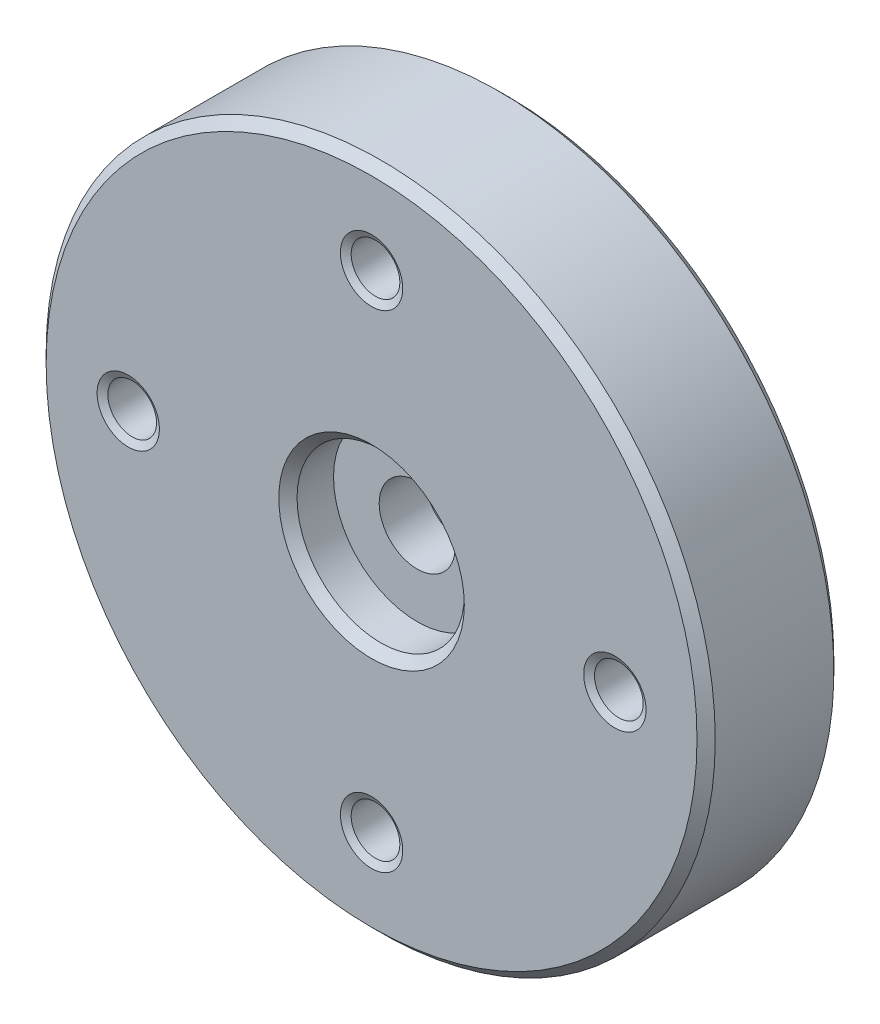
ISO-10303-21;
HEADER;
FILE_DESCRIPTION(('STEP AP214'),'2;1');
FILE_NAME('part.step','',(''),(''),'','','');
FILE_SCHEMA(('AUTOMOTIVE_DESIGN { 1 0 10303 214 1 1 1 1 }'));
ENDSEC;
DATA;
#1=APPLICATION_CONTEXT('core data for automotive mechanical design processes');
#2=APPLICATION_PROTOCOL_DEFINITION('international standard','automotive_design',2000,#1);
#3=PRODUCT_CONTEXT('',#1,'mechanical');
#4=PRODUCT('Part','Part','',(#3));
#5=PRODUCT_RELATED_PRODUCT_CATEGORY('part','',(#4));
#6=PRODUCT_DEFINITION_FORMATION('','',#4);
#7=PRODUCT_DEFINITION_CONTEXT('part definition',#1,'design');
#8=PRODUCT_DEFINITION('design','',#6,#7);
#9=PRODUCT_DEFINITION_SHAPE('','',#8);
#10=(LENGTH_UNIT() NAMED_UNIT(*) SI_UNIT(.MILLI.,.METRE.));
#11=(NAMED_UNIT(*) PLANE_ANGLE_UNIT() SI_UNIT($,.RADIAN.));
#12=(NAMED_UNIT(*) SI_UNIT($,.STERADIAN.) SOLID_ANGLE_UNIT());
#13=UNCERTAINTY_MEASURE_WITH_UNIT(LENGTH_MEASURE(1.E-05),#10,'distance_accuracy_value','');
#14=(GEOMETRIC_REPRESENTATION_CONTEXT(3) GLOBAL_UNCERTAINTY_ASSIGNED_CONTEXT((#13)) GLOBAL_UNIT_ASSIGNED_CONTEXT((#10,
#11,#12)) REPRESENTATION_CONTEXT('',''));
#15=CARTESIAN_POINT('',(0.,0.,0.));
#16=DIRECTION('',(0.,0.,1.));
#17=DIRECTION('',(1.,0.,0.));
#18=AXIS2_PLACEMENT_3D('',#15,#16,#17);
#19=CARTESIAN_POINT('',(0.,0.,0.));
#20=DIRECTION('',(0.,0.,-1.));
#21=DIRECTION('',(-1.,0.,0.));
#22=AXIS2_PLACEMENT_3D('',#19,#20,#21);
#23=CYLINDRICAL_SURFACE('',#22,2.75);
#24=CARTESIAN_POINT('',(0.,0.,-0.300000000000006));
#25=DIRECTION('',(0.,0.,1.));
#26=DIRECTION('',(1.,0.,0.));
#27=AXIS2_PLACEMENT_3D('',#24,#25,#26);
#28=CIRCLE('',#27,2.75);
#29=CARTESIAN_POINT('',(2.75,0.,-0.300000000000006));
#30=VERTEX_POINT('',#29);
#31=EDGE_CURVE('E59',#30,#30,#28,.T.);
#32=ORIENTED_EDGE('',*,*,#31,.T.);
#33=EDGE_LOOP('',(#32));
#34=FACE_BOUND('',#33,.T.);
#35=CARTESIAN_POINT('',(0.,0.,-1.5));
#36=DIRECTION('',(0.,0.,-1.));
#37=DIRECTION('',(-1.,0.,0.));
#38=AXIS2_PLACEMENT_3D('',#35,#36,#37);
#39=CIRCLE('',#38,2.75);
#40=CARTESIAN_POINT('',(-2.75,0.,-1.5));
#41=VERTEX_POINT('',#40);
#42=EDGE_CURVE('E83',#41,#41,#39,.T.);
#43=ORIENTED_EDGE('',*,*,#42,.T.);
#44=EDGE_LOOP('',(#43));
#45=FACE_BOUND('',#44,.T.);
#46=ADVANCED_FACE('F36',(#34,#45),#23,.F.);
#47=CARTESIAN_POINT('',(0.,2.75,0.));
#48=DIRECTION('',(0.,0.,1.));
#49=DIRECTION('',(1.,0.,0.));
#50=AXIS2_PLACEMENT_3D('',#47,#48,#49);
#51=PLANE('',#50);
#52=CARTESIAN_POINT('',(0.,0.,0.));
#53=DIRECTION('',(0.,0.,1.));
#54=DIRECTION('',(1.,0.,0.));
#55=AXIS2_PLACEMENT_3D('',#52,#53,#54);
#56=CIRCLE('',#55,3.05);
#57=CARTESIAN_POINT('',(3.05,0.,0.));
#58=VERTEX_POINT('',#57);
#59=EDGE_CURVE('E62',#58,#58,#56,.F.);
#60=ORIENTED_EDGE('',*,*,#59,.T.);
#61=EDGE_LOOP('',(#60));
#62=FACE_BOUND('',#61,.T.);
#63=CARTESIAN_POINT('',(0.,0.,0.));
#64=DIRECTION('',(0.,0.,1.));
#65=DIRECTION('',(1.,0.,0.));
#66=AXIS2_PLACEMENT_3D('',#63,#64,#65);
#67=CIRCLE('',#66,10.7);
#68=CARTESIAN_POINT('',(10.7,0.,0.));
#69=VERTEX_POINT('',#68);
#70=EDGE_CURVE('E65',#69,#69,#67,.T.);
#71=ORIENTED_EDGE('',*,*,#70,.T.);
#72=EDGE_LOOP('',(#71));
#73=FACE_BOUND('',#72,.T.);
#74=CARTESIAN_POINT('',(0.,8.,0.));
#75=DIRECTION('',(0.,0.,1.));
#76=DIRECTION('',(1.,0.,0.));
#77=AXIS2_PLACEMENT_3D('',#74,#75,#76);
#78=CIRCLE('',#77,1.025);
#79=CARTESIAN_POINT('',(1.025,8.,0.));
#80=VERTEX_POINT('',#79);
#81=EDGE_CURVE('E128',#80,#80,#78,.T.);
#82=ORIENTED_EDGE('',*,*,#81,.F.);
#83=EDGE_LOOP('',(#82));
#84=FACE_BOUND('',#83,.T.);
#85=CARTESIAN_POINT('',(8.,0.,0.));
#86=DIRECTION('',(0.,0.,1.));
#87=DIRECTION('',(1.,0.,0.));
#88=AXIS2_PLACEMENT_3D('',#85,#86,#87);
#89=CIRCLE('',#88,1.025);
#90=CARTESIAN_POINT('',(9.025,0.,0.));
#91=VERTEX_POINT('',#90);
#92=EDGE_CURVE('E116',#91,#91,#89,.T.);
#93=ORIENTED_EDGE('',*,*,#92,.F.);
#94=EDGE_LOOP('',(#93));
#95=FACE_BOUND('',#94,.T.);
#96=CARTESIAN_POINT('',(0.,-8.,0.));
#97=DIRECTION('',(0.,0.,1.));
#98=DIRECTION('',(1.,0.,0.));
#99=AXIS2_PLACEMENT_3D('',#96,#97,#98);
#100=CIRCLE('',#99,1.025);
#101=CARTESIAN_POINT('',(1.025,-8.,0.));
#102=VERTEX_POINT('',#101);
#103=EDGE_CURVE('E104',#102,#102,#100,.T.);
#104=ORIENTED_EDGE('',*,*,#103,.F.);
#105=EDGE_LOOP('',(#104));
#106=FACE_BOUND('',#105,.T.);
#107=CARTESIAN_POINT('',(-8.,0.,0.));
#108=DIRECTION('',(0.,0.,1.));
#109=DIRECTION('',(1.,0.,0.));
#110=AXIS2_PLACEMENT_3D('',#107,#108,#109);
#111=CIRCLE('',#110,1.025);
#112=CARTESIAN_POINT('',(-6.975,0.,0.));
#113=VERTEX_POINT('',#112);
#114=EDGE_CURVE('E92',#113,#113,#111,.T.);
#115=ORIENTED_EDGE('',*,*,#114,.F.);
#116=EDGE_LOOP('',(#115));
#117=FACE_BOUND('',#116,.T.);
#118=ADVANCED_FACE('F158',(#62,#73,#84,#95,#106,#117),#51,.T.);
#119=CARTESIAN_POINT('',(0.,0.,0.));
#120=DIRECTION('',(0.,0.,-1.));
#121=DIRECTION('',(-1.,0.,0.));
#122=AXIS2_PLACEMENT_3D('',#119,#120,#121);
#123=CYLINDRICAL_SURFACE('',#122,11.);
#124=CARTESIAN_POINT('',(0.,0.,-4.2));
#125=DIRECTION('',(0.,0.,-1.));
#126=DIRECTION('',(-1.,0.,0.));
#127=AXIS2_PLACEMENT_3D('',#124,#125,#126);
#128=CIRCLE('',#127,11.);
#129=CARTESIAN_POINT('',(-11.,0.,-4.2));
#130=VERTEX_POINT('',#129);
#131=EDGE_CURVE('E10',#130,#130,#128,.F.);
#132=ORIENTED_EDGE('',*,*,#131,.T.);
#133=EDGE_LOOP('',(#132));
#134=FACE_BOUND('',#133,.T.);
#135=CARTESIAN_POINT('',(0.,0.,-0.299999999999998));
#136=DIRECTION('',(0.,0.,1.));
#137=DIRECTION('',(1.,0.,0.));
#138=AXIS2_PLACEMENT_3D('',#135,#136,#137);
#139=CIRCLE('',#138,11.);
#140=CARTESIAN_POINT('',(11.,0.,-0.299999999999998));
#141=VERTEX_POINT('',#140);
#142=EDGE_CURVE('E43',#141,#141,#139,.F.);
#143=ORIENTED_EDGE('',*,*,#142,.T.);
#144=EDGE_LOOP('',(#143));
#145=FACE_BOUND('',#144,.T.);
#146=ADVANCED_FACE('F161',(#134,#145),#123,.T.);
#147=CARTESIAN_POINT('',(0.,11.,-4.5));
#148=DIRECTION('',(0.,0.,-1.));
#149=DIRECTION('',(-1.,0.,0.));
#150=AXIS2_PLACEMENT_3D('',#147,#148,#149);
#151=PLANE('',#150);
#152=CARTESIAN_POINT('',(0.,0.,-4.5));
#153=DIRECTION('',(0.,0.,-1.));
#154=DIRECTION('',(-1.,0.,0.));
#155=AXIS2_PLACEMENT_3D('',#152,#153,#154);
#156=CIRCLE('',#155,10.7);
#157=CARTESIAN_POINT('',(-10.7,0.,-4.5));
#158=VERTEX_POINT('',#157);
#159=EDGE_CURVE('E47',#158,#158,#156,.T.);
#160=ORIENTED_EDGE('',*,*,#159,.T.);
#161=EDGE_LOOP('',(#160));
#162=FACE_BOUND('',#161,.T.);
#163=CARTESIAN_POINT('',(0.,8.,-4.5));
#164=DIRECTION('',(0.,0.,1.));
#165=DIRECTION('',(1.,0.,0.));
#166=AXIS2_PLACEMENT_3D('',#163,#164,#165);
#167=CIRCLE('',#166,1.025);
#168=CARTESIAN_POINT('',(1.025,8.,-4.5));
#169=VERTEX_POINT('',#168);
#170=EDGE_CURVE('E131',#169,#169,#167,.T.);
#171=ORIENTED_EDGE('',*,*,#170,.T.);
#172=EDGE_LOOP('',(#171));
#173=FACE_BOUND('',#172,.T.);
#174=CARTESIAN_POINT('',(8.,0.,-4.5));
#175=DIRECTION('',(0.,0.,1.));
#176=DIRECTION('',(1.,0.,0.));
#177=AXIS2_PLACEMENT_3D('',#174,#175,#176);
#178=CIRCLE('',#177,1.025);
#179=CARTESIAN_POINT('',(9.025,0.,-4.5));
#180=VERTEX_POINT('',#179);
#181=EDGE_CURVE('E119',#180,#180,#178,.T.);
#182=ORIENTED_EDGE('',*,*,#181,.T.);
#183=EDGE_LOOP('',(#182));
#184=FACE_BOUND('',#183,.T.);
#185=CARTESIAN_POINT('',(0.,-8.,-4.5));
#186=DIRECTION('',(0.,0.,1.));
#187=DIRECTION('',(1.,0.,0.));
#188=AXIS2_PLACEMENT_3D('',#185,#186,#187);
#189=CIRCLE('',#188,1.025);
#190=CARTESIAN_POINT('',(1.025,-8.,-4.5));
#191=VERTEX_POINT('',#190);
#192=EDGE_CURVE('E107',#191,#191,#189,.T.);
#193=ORIENTED_EDGE('',*,*,#192,.T.);
#194=EDGE_LOOP('',(#193));
#195=FACE_BOUND('',#194,.T.);
#196=CARTESIAN_POINT('',(-8.,0.,-4.5));
#197=DIRECTION('',(0.,0.,1.));
#198=DIRECTION('',(1.,0.,0.));
#199=AXIS2_PLACEMENT_3D('',#196,#197,#198);
#200=CIRCLE('',#199,1.025);
#201=CARTESIAN_POINT('',(-6.975,0.,-4.5));
#202=VERTEX_POINT('',#201);
#203=EDGE_CURVE('E95',#202,#202,#200,.T.);
#204=ORIENTED_EDGE('',*,*,#203,.T.);
#205=EDGE_LOOP('',(#204));
#206=FACE_BOUND('',#205,.T.);
#207=CARTESIAN_POINT('',(0.,0.,-4.5));
#208=DIRECTION('',(0.,0.,-1.));
#209=DIRECTION('',(-1.,0.,0.));
#210=AXIS2_PLACEMENT_3D('',#207,#208,#209);
#211=CIRCLE('',#210,4.5);
#212=CARTESIAN_POINT('',(-4.5,0.,-4.5));
#213=VERTEX_POINT('',#212);
#214=EDGE_CURVE('E68',#213,#213,#211,.T.);
#215=ORIENTED_EDGE('',*,*,#214,.F.);
#216=EDGE_LOOP('',(#215));
#217=FACE_BOUND('',#216,.T.);
#218=ADVANCED_FACE('F135',(#162,#173,#184,#195,#206,#217),#151,.T.);
#219=CARTESIAN_POINT('',(0.,0.,0.));
#220=DIRECTION('',(0.,0.,-1.));
#221=DIRECTION('',(-1.,0.,0.));
#222=AXIS2_PLACEMENT_3D('',#219,#220,#221);
#223=CYLINDRICAL_SURFACE('',#222,4.5);
#224=CARTESIAN_POINT('',(0.,0.,-6.4));
#225=DIRECTION('',(0.,0.,-1.));
#226=DIRECTION('',(-1.,0.,0.));
#227=AXIS2_PLACEMENT_3D('',#224,#225,#226);
#228=CIRCLE('',#227,4.5);
#229=CARTESIAN_POINT('',(-4.5,0.,-6.4));
#230=VERTEX_POINT('',#229);
#231=EDGE_CURVE('E51',#230,#230,#228,.F.);
#232=ORIENTED_EDGE('',*,*,#231,.T.);
#233=EDGE_LOOP('',(#232));
#234=FACE_BOUND('',#233,.T.);
#235=ORIENTED_EDGE('',*,*,#214,.T.);
#236=EDGE_LOOP('',(#235));
#237=FACE_BOUND('',#236,.T.);
#238=ADVANCED_FACE('F212',(#234,#237),#223,.T.);
#239=CARTESIAN_POINT('',(0.,4.5,-6.7));
#240=DIRECTION('',(0.,0.,-1.));
#241=DIRECTION('',(-1.,0.,0.));
#242=AXIS2_PLACEMENT_3D('',#239,#240,#241);
#243=PLANE('',#242);
#244=CARTESIAN_POINT('',(0.,0.,-6.7));
#245=DIRECTION('',(0.,0.,-1.));
#246=DIRECTION('',(-1.,0.,0.));
#247=AXIS2_PLACEMENT_3D('',#244,#245,#246);
#248=CIRCLE('',#247,4.2);
#249=CARTESIAN_POINT('',(-4.2,0.,-6.7));
#250=VERTEX_POINT('',#249);
#251=EDGE_CURVE('E56',#250,#250,#248,.T.);
#252=ORIENTED_EDGE('',*,*,#251,.T.);
#253=EDGE_LOOP('',(#252));
#254=FACE_BOUND('',#253,.T.);
#255=CARTESIAN_POINT('',(0.,0.,-6.7));
#256=DIRECTION('',(0.,0.,-1.));
#257=DIRECTION('',(-1.,0.,0.));
#258=AXIS2_PLACEMENT_3D('',#255,#256,#257);
#259=CIRCLE('',#258,2.75);
#260=CARTESIAN_POINT('',(-2.75,0.,-6.7));
#261=VERTEX_POINT('',#260);
#262=EDGE_CURVE('E71',#261,#261,#259,.T.);
#263=ORIENTED_EDGE('',*,*,#262,.F.);
#264=EDGE_LOOP('',(#263));
#265=FACE_BOUND('',#264,.T.);
#266=ADVANCED_FACE('F218',(#254,#265),#243,.T.);
#267=CARTESIAN_POINT('',(0.,0.,0.));
#268=DIRECTION('',(0.,0.,-1.));
#269=DIRECTION('',(-1.,0.,0.));
#270=AXIS2_PLACEMENT_3D('',#267,#268,#269);
#271=CYLINDRICAL_SURFACE('',#270,2.75);
#272=ORIENTED_EDGE('',*,*,#262,.T.);
#273=EDGE_LOOP('',(#272));
#274=FACE_BOUND('',#273,.T.);
#275=CARTESIAN_POINT('',(0.,0.,-3.));
#276=DIRECTION('',(0.,0.,-1.));
#277=DIRECTION('',(-1.,0.,0.));
#278=AXIS2_PLACEMENT_3D('',#275,#276,#277);
#279=CIRCLE('',#278,2.75);
#280=CARTESIAN_POINT('',(-2.75,0.,-3.));
#281=VERTEX_POINT('',#280);
#282=EDGE_CURVE('E74',#281,#281,#279,.T.);
#283=ORIENTED_EDGE('',*,*,#282,.F.);
#284=EDGE_LOOP('',(#283));
#285=FACE_BOUND('',#284,.T.);
#286=ADVANCED_FACE('F224',(#274,#285),#271,.F.);
#287=CARTESIAN_POINT('',(0.,2.75,-3.));
#288=DIRECTION('',(0.,0.,-1.));
#289=DIRECTION('',(-1.,0.,0.));
#290=AXIS2_PLACEMENT_3D('',#287,#288,#289);
#291=PLANE('',#290);
#292=ORIENTED_EDGE('',*,*,#282,.T.);
#293=EDGE_LOOP('',(#292));
#294=FACE_BOUND('',#293,.T.);
#295=CARTESIAN_POINT('',(0.,0.,-3.));
#296=DIRECTION('',(0.,0.,-1.));
#297=DIRECTION('',(-1.,0.,0.));
#298=AXIS2_PLACEMENT_3D('',#295,#296,#297);
#299=CIRCLE('',#298,1.25);
#300=CARTESIAN_POINT('',(-1.25,0.,-3.));
#301=VERTEX_POINT('',#300);
#302=EDGE_CURVE('E77',#301,#301,#299,.T.);
#303=ORIENTED_EDGE('',*,*,#302,.F.);
#304=EDGE_LOOP('',(#303));
#305=FACE_BOUND('',#304,.T.);
#306=ADVANCED_FACE('F228',(#294,#305),#291,.T.);
#307=CARTESIAN_POINT('',(0.,0.,0.));
#308=DIRECTION('',(0.,0.,-1.));
#309=DIRECTION('',(-1.,0.,0.));
#310=AXIS2_PLACEMENT_3D('',#307,#308,#309);
#311=CYLINDRICAL_SURFACE('',#310,1.25);
#312=ORIENTED_EDGE('',*,*,#302,.T.);
#313=EDGE_LOOP('',(#312));
#314=FACE_BOUND('',#313,.T.);
#315=CARTESIAN_POINT('',(0.,0.,-1.5));
#316=DIRECTION('',(0.,0.,-1.));
#317=DIRECTION('',(-1.,0.,0.));
#318=AXIS2_PLACEMENT_3D('',#315,#316,#317);
#319=CIRCLE('',#318,1.25);
#320=CARTESIAN_POINT('',(-1.25,0.,-1.5));
#321=VERTEX_POINT('',#320);
#322=EDGE_CURVE('E80',#321,#321,#319,.T.);
#323=ORIENTED_EDGE('',*,*,#322,.F.);
#324=EDGE_LOOP('',(#323));
#325=FACE_BOUND('',#324,.T.);
#326=ADVANCED_FACE('F232',(#314,#325),#311,.F.);
#327=CARTESIAN_POINT('',(0.,2.75,-1.5));
#328=DIRECTION('',(0.,0.,1.));
#329=DIRECTION('',(1.,0.,0.));
#330=AXIS2_PLACEMENT_3D('',#327,#328,#329);
#331=PLANE('',#330);
#332=ORIENTED_EDGE('',*,*,#322,.T.);
#333=EDGE_LOOP('',(#332));
#334=FACE_BOUND('',#333,.T.);
#335=ORIENTED_EDGE('',*,*,#42,.F.);
#336=EDGE_LOOP('',(#335));
#337=FACE_BOUND('',#336,.T.);
#338=ADVANCED_FACE('F236',(#334,#337),#331,.T.);
#339=CARTESIAN_POINT('',(-8.,0.,-4.37009618943233));
#340=DIRECTION('',(0.,0.,-1.));
#341=DIRECTION('',(-1.,0.,0.));
#342=AXIS2_PLACEMENT_3D('',#339,#340,#341);
#343=CONICAL_SURFACE('',#342,0.799999999999999,1.0471975511966);
#344=ORIENTED_EDGE('',*,*,#203,.F.);
#345=EDGE_LOOP('',(#344));
#346=FACE_BOUND('',#345,.T.);
#347=CARTESIAN_POINT('',(-8.,0.,-4.37009618943233));
#348=DIRECTION('',(0.,0.,1.));
#349=DIRECTION('',(1.,0.,0.));
#350=AXIS2_PLACEMENT_3D('',#347,#348,#349);
#351=CIRCLE('',#350,0.799999999999999);
#352=CARTESIAN_POINT('',(-7.2,0.,-4.37009618943233));
#353=VERTEX_POINT('',#352);
#354=EDGE_CURVE('E86',#353,#353,#351,.T.);
#355=ORIENTED_EDGE('',*,*,#354,.T.);
#356=EDGE_LOOP('',(#355));
#357=FACE_BOUND('',#356,.T.);
#358=ADVANCED_FACE('F183',(#346,#357),#343,.F.);
#359=CARTESIAN_POINT('',(-8.,0.,0.));
#360=DIRECTION('',(0.,0.,1.));
#361=DIRECTION('',(1.,0.,0.));
#362=AXIS2_PLACEMENT_3D('',#359,#360,#361);
#363=CYLINDRICAL_SURFACE('',#362,0.799999999999999);
#364=ORIENTED_EDGE('',*,*,#354,.F.);
#365=EDGE_LOOP('',(#364));
#366=FACE_BOUND('',#365,.T.);
#367=CARTESIAN_POINT('',(-8.,0.,-0.129903810567662));
#368=DIRECTION('',(0.,0.,1.));
#369=DIRECTION('',(1.,0.,0.));
#370=AXIS2_PLACEMENT_3D('',#367,#368,#369);
#371=CIRCLE('',#370,0.8);
#372=CARTESIAN_POINT('',(-7.2,0.,-0.129903810567662));
#373=VERTEX_POINT('',#372);
#374=EDGE_CURVE('E89',#373,#373,#371,.T.);
#375=ORIENTED_EDGE('',*,*,#374,.T.);
#376=EDGE_LOOP('',(#375));
#377=FACE_BOUND('',#376,.T.);
#378=ADVANCED_FACE('F173',(#366,#377),#363,.F.);
#379=CARTESIAN_POINT('',(-8.,0.,0.));
#380=DIRECTION('',(0.,0.,1.));
#381=DIRECTION('',(1.,0.,0.));
#382=AXIS2_PLACEMENT_3D('',#379,#380,#381);
#383=CONICAL_SURFACE('',#382,1.025,1.0471975511966);
#384=ORIENTED_EDGE('',*,*,#374,.F.);
#385=EDGE_LOOP('',(#384));
#386=FACE_BOUND('',#385,.T.);
#387=ORIENTED_EDGE('',*,*,#114,.T.);
#388=EDGE_LOOP('',(#387));
#389=FACE_BOUND('',#388,.T.);
#390=ADVANCED_FACE('F170',(#386,#389),#383,.F.);
#391=CARTESIAN_POINT('',(0.,-8.,-4.37009618943233));
#392=DIRECTION('',(0.,0.,-1.));
#393=DIRECTION('',(-1.,0.,0.));
#394=AXIS2_PLACEMENT_3D('',#391,#392,#393);
#395=CONICAL_SURFACE('',#394,0.799999999999999,1.0471975511966);
#396=ORIENTED_EDGE('',*,*,#192,.F.);
#397=EDGE_LOOP('',(#396));
#398=FACE_BOUND('',#397,.T.);
#399=CARTESIAN_POINT('',(0.,-8.,-4.37009618943233));
#400=DIRECTION('',(0.,0.,1.));
#401=DIRECTION('',(1.,0.,0.));
#402=AXIS2_PLACEMENT_3D('',#399,#400,#401);
#403=CIRCLE('',#402,0.799999999999999);
#404=CARTESIAN_POINT('',(0.799999999999999,-8.,-4.37009618943233));
#405=VERTEX_POINT('',#404);
#406=EDGE_CURVE('E98',#405,#405,#403,.T.);
#407=ORIENTED_EDGE('',*,*,#406,.T.);
#408=EDGE_LOOP('',(#407));
#409=FACE_BOUND('',#408,.T.);
#410=ADVANCED_FACE('F172',(#398,#409),#395,.F.);
#411=CARTESIAN_POINT('',(0.,-8.,0.));
#412=DIRECTION('',(0.,0.,1.));
#413=DIRECTION('',(1.,0.,0.));
#414=AXIS2_PLACEMENT_3D('',#411,#412,#413);
#415=CYLINDRICAL_SURFACE('',#414,0.799999999999999);
#416=ORIENTED_EDGE('',*,*,#406,.F.);
#417=EDGE_LOOP('',(#416));
#418=FACE_BOUND('',#417,.T.);
#419=CARTESIAN_POINT('',(0.,-8.,-0.129903810567662));
#420=DIRECTION('',(0.,0.,1.));
#421=DIRECTION('',(1.,0.,0.));
#422=AXIS2_PLACEMENT_3D('',#419,#420,#421);
#423=CIRCLE('',#422,0.8);
#424=CARTESIAN_POINT('',(0.8,-8.,-0.129903810567662));
#425=VERTEX_POINT('',#424);
#426=EDGE_CURVE('E101',#425,#425,#423,.T.);
#427=ORIENTED_EDGE('',*,*,#426,.T.);
#428=EDGE_LOOP('',(#427));
#429=FACE_BOUND('',#428,.T.);
#430=ADVANCED_FACE('F180',(#418,#429),#415,.F.);
#431=CARTESIAN_POINT('',(0.,-8.,0.));
#432=DIRECTION('',(0.,0.,1.));
#433=DIRECTION('',(1.,0.,0.));
#434=AXIS2_PLACEMENT_3D('',#431,#432,#433);
#435=CONICAL_SURFACE('',#434,1.025,1.0471975511966);
#436=ORIENTED_EDGE('',*,*,#426,.F.);
#437=EDGE_LOOP('',(#436));
#438=FACE_BOUND('',#437,.T.);
#439=ORIENTED_EDGE('',*,*,#103,.T.);
#440=EDGE_LOOP('',(#439));
#441=FACE_BOUND('',#440,.T.);
#442=ADVANCED_FACE('F335',(#438,#441),#435,.F.);
#443=CARTESIAN_POINT('',(8.,0.,-4.37009618943233));
#444=DIRECTION('',(0.,0.,-1.));
#445=DIRECTION('',(-1.,0.,0.));
#446=AXIS2_PLACEMENT_3D('',#443,#444,#445);
#447=CONICAL_SURFACE('',#446,0.799999999999999,1.04719755119659);
#448=ORIENTED_EDGE('',*,*,#181,.F.);
#449=EDGE_LOOP('',(#448));
#450=FACE_BOUND('',#449,.T.);
#451=CARTESIAN_POINT('',(8.,0.,-4.37009618943233));
#452=DIRECTION('',(0.,0.,1.));
#453=DIRECTION('',(1.,0.,0.));
#454=AXIS2_PLACEMENT_3D('',#451,#452,#453);
#455=CIRCLE('',#454,0.799999999999999);
#456=CARTESIAN_POINT('',(8.8,0.,-4.37009618943233));
#457=VERTEX_POINT('',#456);
#458=EDGE_CURVE('E110',#457,#457,#455,.T.);
#459=ORIENTED_EDGE('',*,*,#458,.T.);
#460=EDGE_LOOP('',(#459));
#461=FACE_BOUND('',#460,.T.);
#462=ADVANCED_FACE('F326',(#450,#461),#447,.F.);
#463=CARTESIAN_POINT('',(8.,0.,0.));
#464=DIRECTION('',(0.,0.,1.));
#465=DIRECTION('',(1.,0.,0.));
#466=AXIS2_PLACEMENT_3D('',#463,#464,#465);
#467=CYLINDRICAL_SURFACE('',#466,0.799999999999999);
#468=ORIENTED_EDGE('',*,*,#458,.F.);
#469=EDGE_LOOP('',(#468));
#470=FACE_BOUND('',#469,.T.);
#471=CARTESIAN_POINT('',(8.,0.,-0.129903810567662));
#472=DIRECTION('',(0.,0.,1.));
#473=DIRECTION('',(1.,0.,0.));
#474=AXIS2_PLACEMENT_3D('',#471,#472,#473);
#475=CIRCLE('',#474,0.8);
#476=CARTESIAN_POINT('',(8.8,0.,-0.129903810567662));
#477=VERTEX_POINT('',#476);
#478=EDGE_CURVE('E113',#477,#477,#475,.T.);
#479=ORIENTED_EDGE('',*,*,#478,.T.);
#480=EDGE_LOOP('',(#479));
#481=FACE_BOUND('',#480,.T.);
#482=ADVANCED_FACE('F317',(#470,#481),#467,.F.);
#483=CARTESIAN_POINT('',(8.,0.,0.));
#484=DIRECTION('',(0.,0.,1.));
#485=DIRECTION('',(1.,0.,0.));
#486=AXIS2_PLACEMENT_3D('',#483,#484,#485);
#487=CONICAL_SURFACE('',#486,1.025,1.0471975511966);
#488=ORIENTED_EDGE('',*,*,#478,.F.);
#489=EDGE_LOOP('',(#488));
#490=FACE_BOUND('',#489,.T.);
#491=ORIENTED_EDGE('',*,*,#92,.T.);
#492=EDGE_LOOP('',(#491));
#493=FACE_BOUND('',#492,.T.);
#494=ADVANCED_FACE('F142',(#490,#493),#487,.F.);
#495=CARTESIAN_POINT('',(0.,8.,-4.37009618943233));
#496=DIRECTION('',(0.,0.,-1.));
#497=DIRECTION('',(-1.,0.,0.));
#498=AXIS2_PLACEMENT_3D('',#495,#496,#497);
#499=CONICAL_SURFACE('',#498,0.799999999999999,1.0471975511966);
#500=ORIENTED_EDGE('',*,*,#170,.F.);
#501=EDGE_LOOP('',(#500));
#502=FACE_BOUND('',#501,.T.);
#503=CARTESIAN_POINT('',(0.,8.,-4.37009618943233));
#504=DIRECTION('',(0.,0.,1.));
#505=DIRECTION('',(1.,0.,0.));
#506=AXIS2_PLACEMENT_3D('',#503,#504,#505);
#507=CIRCLE('',#506,0.799999999999999);
#508=CARTESIAN_POINT('',(0.799999999999999,8.,-4.37009618943233));
#509=VERTEX_POINT('',#508);
#510=EDGE_CURVE('E122',#509,#509,#507,.T.);
#511=ORIENTED_EDGE('',*,*,#510,.T.);
#512=EDGE_LOOP('',(#511));
#513=FACE_BOUND('',#512,.T.);
#514=ADVANCED_FACE('F138',(#502,#513),#499,.F.);
#515=CARTESIAN_POINT('',(0.,8.,0.));
#516=DIRECTION('',(0.,0.,1.));
#517=DIRECTION('',(1.,0.,0.));
#518=AXIS2_PLACEMENT_3D('',#515,#516,#517);
#519=CYLINDRICAL_SURFACE('',#518,0.799999999999999);
#520=ORIENTED_EDGE('',*,*,#510,.F.);
#521=EDGE_LOOP('',(#520));
#522=FACE_BOUND('',#521,.T.);
#523=CARTESIAN_POINT('',(0.,8.,-0.129903810567662));
#524=DIRECTION('',(0.,0.,1.));
#525=DIRECTION('',(1.,0.,0.));
#526=AXIS2_PLACEMENT_3D('',#523,#524,#525);
#527=CIRCLE('',#526,0.8);
#528=CARTESIAN_POINT('',(0.8,8.,-0.129903810567662));
#529=VERTEX_POINT('',#528);
#530=EDGE_CURVE('E125',#529,#529,#527,.T.);
#531=ORIENTED_EDGE('',*,*,#530,.T.);
#532=EDGE_LOOP('',(#531));
#533=FACE_BOUND('',#532,.T.);
#534=ADVANCED_FACE('F141',(#522,#533),#519,.F.);
#535=CARTESIAN_POINT('',(0.,8.,0.));
#536=DIRECTION('',(0.,0.,1.));
#537=DIRECTION('',(1.,0.,0.));
#538=AXIS2_PLACEMENT_3D('',#535,#536,#537);
#539=CONICAL_SURFACE('',#538,1.025,1.0471975511966);
#540=ORIENTED_EDGE('',*,*,#530,.F.);
#541=EDGE_LOOP('',(#540));
#542=FACE_BOUND('',#541,.T.);
#543=ORIENTED_EDGE('',*,*,#81,.T.);
#544=EDGE_LOOP('',(#543));
#545=FACE_BOUND('',#544,.T.);
#546=ADVANCED_FACE('F148',(#542,#545),#539,.F.);
#547=CARTESIAN_POINT('',(0.,0.,0.));
#548=DIRECTION('',(0.,0.,1.));
#549=DIRECTION('',(1.,0.,0.));
#550=AXIS2_PLACEMENT_3D('',#547,#548,#549);
#551=CONICAL_SURFACE('',#550,3.05,0.78539816339744);
#552=ORIENTED_EDGE('',*,*,#31,.F.);
#553=EDGE_LOOP('',(#552));
#554=FACE_BOUND('',#553,.T.);
#555=ORIENTED_EDGE('',*,*,#59,.F.);
#556=EDGE_LOOP('',(#555));
#557=FACE_BOUND('',#556,.T.);
#558=ADVANCED_FACE('F154',(#554,#557),#551,.F.);
#559=CARTESIAN_POINT('',(0.,0.,-6.7));
#560=DIRECTION('',(0.,0.,1.));
#561=DIRECTION('',(1.,0.,0.));
#562=AXIS2_PLACEMENT_3D('',#559,#560,#561);
#563=CONICAL_SURFACE('',#562,4.2,0.785398163397445);
#564=ORIENTED_EDGE('',*,*,#231,.F.);
#565=EDGE_LOOP('',(#564));
#566=FACE_BOUND('',#565,.T.);
#567=ORIENTED_EDGE('',*,*,#251,.F.);
#568=EDGE_LOOP('',(#567));
#569=FACE_BOUND('',#568,.T.);
#570=ADVANCED_FACE('F197',(#566,#569),#563,.T.);
#571=CARTESIAN_POINT('',(0.,0.,-4.5));
#572=DIRECTION('',(0.,0.,1.));
#573=DIRECTION('',(1.,0.,0.));
#574=AXIS2_PLACEMENT_3D('',#571,#572,#573);
#575=CONICAL_SURFACE('',#574,10.7,0.785398163397451);
#576=ORIENTED_EDGE('',*,*,#131,.F.);
#577=EDGE_LOOP('',(#576));
#578=FACE_BOUND('',#577,.T.);
#579=ORIENTED_EDGE('',*,*,#159,.F.);
#580=EDGE_LOOP('',(#579));
#581=FACE_BOUND('',#580,.T.);
#582=ADVANCED_FACE('F200',(#578,#581),#575,.T.);
#583=CARTESIAN_POINT('',(0.,0.,-0.299999999999998));
#584=DIRECTION('',(0.,0.,-1.));
#585=DIRECTION('',(-1.,0.,0.));
#586=AXIS2_PLACEMENT_3D('',#583,#584,#585);
#587=CONICAL_SURFACE('',#586,11.,0.785398163397451);
#588=ORIENTED_EDGE('',*,*,#70,.F.);
#589=EDGE_LOOP('',(#588));
#590=FACE_BOUND('',#589,.T.);
#591=ORIENTED_EDGE('',*,*,#142,.F.);
#592=EDGE_LOOP('',(#591));
#593=FACE_BOUND('',#592,.T.);
#594=ADVANCED_FACE('F38',(#590,#593),#587,.T.);
#595=CLOSED_SHELL('',(#46,#118,#146,#218,#238,#266,#286,#306,#326,#338,#358,#378,#390,#410,#430,
#442,#462,#482,#494,#514,#534,#546,#558,#570,#582,#594));
#596=MANIFOLD_SOLID_BREP('B2',#595);
#597=ADVANCED_BREP_SHAPE_REPRESENTATION('',(#18,#596),#14);
#598=SHAPE_DEFINITION_REPRESENTATION(#9,#597);
ENDSEC;
END-ISO-10303-21;
